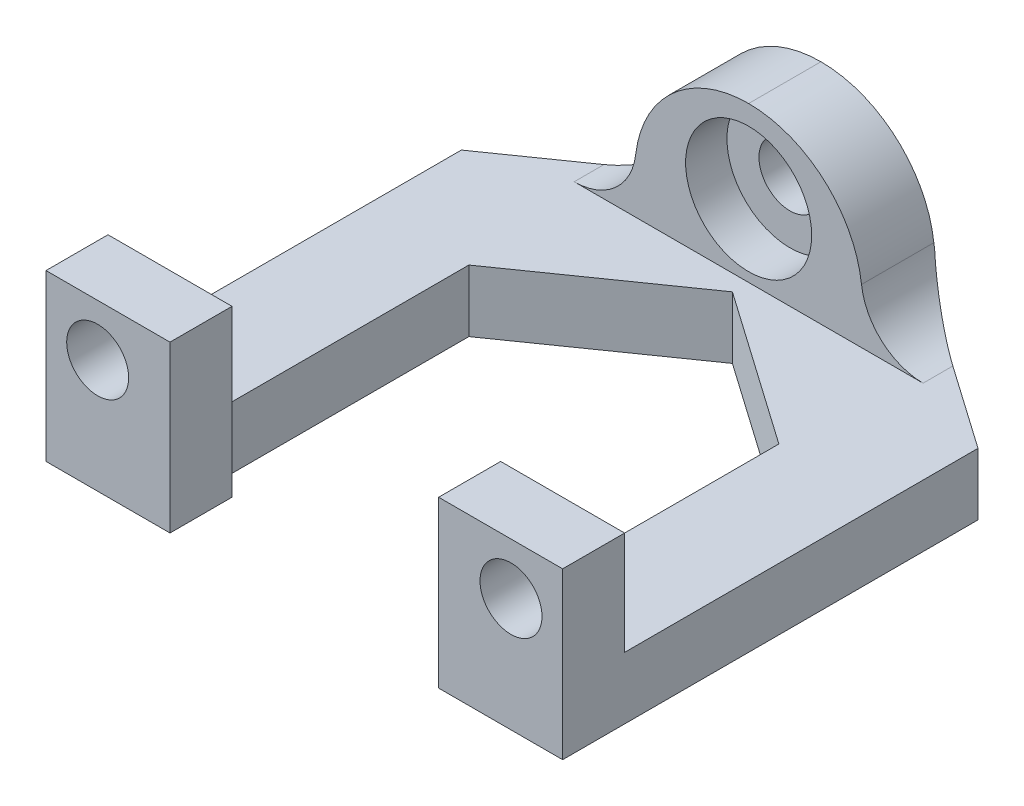
ISO-10303-21;
HEADER;
FILE_DESCRIPTION(('STEP AP214'),'2;1');
FILE_NAME('part.step','',(''),(''),'','','');
FILE_SCHEMA(('AUTOMOTIVE_DESIGN { 1 0 10303 214 1 1 1 1 }'));
ENDSEC;
DATA;
#1=APPLICATION_CONTEXT('core data for automotive mechanical design processes');
#2=APPLICATION_PROTOCOL_DEFINITION('international standard','automotive_design',2000,#1);
#3=PRODUCT_CONTEXT('',#1,'mechanical');
#4=PRODUCT('Part','Part','',(#3));
#5=PRODUCT_RELATED_PRODUCT_CATEGORY('part','',(#4));
#6=PRODUCT_DEFINITION_FORMATION('','',#4);
#7=PRODUCT_DEFINITION_CONTEXT('part definition',#1,'design');
#8=PRODUCT_DEFINITION('design','',#6,#7);
#9=PRODUCT_DEFINITION_SHAPE('','',#8);
#10=(LENGTH_UNIT() NAMED_UNIT(*) SI_UNIT(.MILLI.,.METRE.));
#11=(NAMED_UNIT(*) PLANE_ANGLE_UNIT() SI_UNIT($,.RADIAN.));
#12=(NAMED_UNIT(*) SI_UNIT($,.STERADIAN.) SOLID_ANGLE_UNIT());
#13=UNCERTAINTY_MEASURE_WITH_UNIT(LENGTH_MEASURE(1.E-05),#10,'distance_accuracy_value','');
#14=(GEOMETRIC_REPRESENTATION_CONTEXT(3) GLOBAL_UNCERTAINTY_ASSIGNED_CONTEXT((#13)) GLOBAL_UNIT_ASSIGNED_CONTEXT((#10,
#11,#12)) REPRESENTATION_CONTEXT('',''));
#15=CARTESIAN_POINT('',(0.,0.,0.));
#16=DIRECTION('',(0.,0.,1.));
#17=DIRECTION('',(1.,0.,0.));
#18=AXIS2_PLACEMENT_3D('',#15,#16,#17);
#19=CARTESIAN_POINT('',(-7.5,3.,0.));
#20=DIRECTION('',(-1.,0.,0.));
#21=DIRECTION('',(0.,0.,1.));
#22=AXIS2_PLACEMENT_3D('',#19,#20,#21);
#23=PLANE('',#22);
#24=DIRECTION('',(0.,1.,0.));
#25=VECTOR('',#24,1.);
#26=CARTESIAN_POINT('',(-7.5,0.,9.5));
#27=LINE('',#26,#25);
#28=CARTESIAN_POINT('',(-7.5,0.,9.5));
#29=VERTEX_POINT('',#28);
#30=CARTESIAN_POINT('',(-7.5,3.,9.5));
#31=VERTEX_POINT('',#30);
#32=EDGE_CURVE('E53',#29,#31,#27,.T.);
#33=ORIENTED_EDGE('',*,*,#32,.F.);
#34=DIRECTION('',(0.,0.,-1.));
#35=VECTOR('',#34,1.);
#36=CARTESIAN_POINT('',(-7.5,0.,0.));
#37=LINE('',#36,#35);
#38=CARTESIAN_POINT('',(-7.5,0.,-2.96272917771288));
#39=VERTEX_POINT('',#38);
#40=EDGE_CURVE('E198',#29,#39,#37,.T.);
#41=ORIENTED_EDGE('',*,*,#40,.T.);
#42=DIRECTION('',(0.,-1.,0.));
#43=VECTOR('',#42,1.);
#44=CARTESIAN_POINT('',(-7.5,3.,-2.96272917771288));
#45=LINE('',#44,#43);
#46=CARTESIAN_POINT('',(-7.5,3.,-2.96272917771288));
#47=VERTEX_POINT('',#46);
#48=EDGE_CURVE('E398',#47,#39,#45,.T.);
#49=ORIENTED_EDGE('',*,*,#48,.F.);
#50=DIRECTION('',(0.,0.,-1.));
#51=VECTOR('',#50,1.);
#52=CARTESIAN_POINT('',(-7.5,3.,0.));
#53=LINE('',#52,#51);
#54=EDGE_CURVE('E288',#31,#47,#53,.T.);
#55=ORIENTED_EDGE('',*,*,#54,.F.);
#56=EDGE_LOOP('',(#33,#41,#49,#55));
#57=FACE_BOUND('',#56,.T.);
#58=ADVANCED_FACE('F37',(#57),#23,.F.);
#59=CARTESIAN_POINT('',(7.5,3.,0.));
#60=DIRECTION('',(-1.,0.,0.));
#61=DIRECTION('',(0.,0.,1.));
#62=AXIS2_PLACEMENT_3D('',#59,#60,#61);
#63=PLANE('',#62);
#64=DIRECTION('',(0.,0.,-1.));
#65=VECTOR('',#64,1.);
#66=CARTESIAN_POINT('',(7.5,0.,0.));
#67=LINE('',#66,#65);
#68=CARTESIAN_POINT('',(7.5,0.,9.5));
#69=VERTEX_POINT('',#68);
#70=CARTESIAN_POINT('',(7.5,0.,-2.96272917771288));
#71=VERTEX_POINT('',#70);
#72=EDGE_CURVE('E61',#69,#71,#67,.T.);
#73=ORIENTED_EDGE('',*,*,#72,.F.);
#74=DIRECTION('',(0.,-1.,0.));
#75=VECTOR('',#74,1.);
#76=CARTESIAN_POINT('',(7.5,0.,9.5));
#77=LINE('',#76,#75);
#78=CARTESIAN_POINT('',(7.5,3.,9.5));
#79=VERTEX_POINT('',#78);
#80=EDGE_CURVE('E229',#79,#69,#77,.T.);
#81=ORIENTED_EDGE('',*,*,#80,.F.);
#82=DIRECTION('',(0.,0.,-1.));
#83=VECTOR('',#82,1.);
#84=CARTESIAN_POINT('',(7.5,3.,0.));
#85=LINE('',#84,#83);
#86=CARTESIAN_POINT('',(7.5,3.,-2.96272917771288));
#87=VERTEX_POINT('',#86);
#88=EDGE_CURVE('E479',#79,#87,#85,.T.);
#89=ORIENTED_EDGE('',*,*,#88,.T.);
#90=DIRECTION('',(0.,-1.,0.));
#91=VECTOR('',#90,1.);
#92=CARTESIAN_POINT('',(7.5,3.,-2.96272917771288));
#93=LINE('',#92,#91);
#94=EDGE_CURVE('E405',#87,#71,#93,.T.);
#95=ORIENTED_EDGE('',*,*,#94,.T.);
#96=EDGE_LOOP('',(#73,#81,#89,#95));
#97=FACE_BOUND('',#96,.T.);
#98=ADVANCED_FACE('F439',(#97),#63,.T.);
#99=CARTESIAN_POINT('',(0.,6.5,12.5));
#100=DIRECTION('',(0.,0.,-1.));
#101=DIRECTION('',(-1.,0.,0.));
#102=AXIS2_PLACEMENT_3D('',#99,#100,#101);
#103=CYLINDRICAL_SURFACE('',#102,1.5);
#104=CARTESIAN_POINT('',(0.,6.5,-12.5));
#105=DIRECTION('',(0.,0.,-1.));
#106=DIRECTION('',(-1.,0.,0.));
#107=AXIS2_PLACEMENT_3D('',#104,#105,#106);
#108=CIRCLE('',#107,1.5);
#109=CARTESIAN_POINT('',(-1.5,6.5,-12.5));
#110=VERTEX_POINT('',#109);
#111=EDGE_CURVE('E247',#110,#110,#108,.T.);
#112=ORIENTED_EDGE('',*,*,#111,.T.);
#113=EDGE_LOOP('',(#112));
#114=FACE_BOUND('',#113,.T.);
#115=CARTESIAN_POINT('',(0.,6.5,-11.));
#116=DIRECTION('',(0.,0.,1.));
#117=DIRECTION('',(1.,0.,0.));
#118=AXIS2_PLACEMENT_3D('',#115,#116,#117);
#119=CIRCLE('',#118,1.5);
#120=CARTESIAN_POINT('',(1.5,6.5,-11.));
#121=VERTEX_POINT('',#120);
#122=EDGE_CURVE('E41',#121,#121,#119,.F.);
#123=ORIENTED_EDGE('',*,*,#122,.F.);
#124=EDGE_LOOP('',(#123));
#125=FACE_BOUND('',#124,.T.);
#126=ADVANCED_FACE('F444',(#114,#125),#103,.F.);
#127=CARTESIAN_POINT('',(0.,3.,0.));
#128=DIRECTION('',(0.,1.,0.));
#129=DIRECTION('',(0.,0.,1.));
#130=AXIS2_PLACEMENT_3D('',#127,#128,#129);
#131=PLANE('',#130);
#132=DIRECTION('',(1.,0.,0.));
#133=VECTOR('',#132,1.);
#134=CARTESIAN_POINT('',(-5.5,3.,-9.));
#135=LINE('',#134,#133);
#136=CARTESIAN_POINT('',(-8.44097150806707,3.,-9.));
#137=VERTEX_POINT('',#136);
#138=CARTESIAN_POINT('',(8.44097150806707,3.,-9.));
#139=VERTEX_POINT('',#138);
#140=EDGE_CURVE('E251',#137,#139,#135,.T.);
#141=ORIENTED_EDGE('',*,*,#140,.F.);
#142=DIRECTION('',(0.,0.,1.));
#143=VECTOR('',#142,1.);
#144=CARTESIAN_POINT('',(-8.44097150806707,3.,-12.5));
#145=LINE('',#144,#143);
#146=CARTESIAN_POINT('',(-8.44097150806707,3.,-10.4407095803915));
#147=VERTEX_POINT('',#146);
#148=EDGE_CURVE('E333',#137,#147,#145,.F.);
#149=ORIENTED_EDGE('',*,*,#148,.T.);
#150=DIRECTION('',(0.819152044288993,0.,-0.573576436351044));
#151=VECTOR('',#150,1.);
#152=CARTESIAN_POINT('',(-7.68252348576631,3.,-10.9717806029467));
#153=LINE('',#152,#151);
#154=CARTESIAN_POINT('',(-12.5,3.,-7.59854723253204));
#155=VERTEX_POINT('',#154);
#156=EDGE_CURVE('E303',#147,#155,#153,.F.);
#157=ORIENTED_EDGE('',*,*,#156,.T.);
#158=DIRECTION('',(0.,0.,-1.));
#159=VECTOR('',#158,1.);
#160=CARTESIAN_POINT('',(-12.5,3.,0.));
#161=LINE('',#160,#159);
#162=CARTESIAN_POINT('',(-12.5,3.,9.5));
#163=VERTEX_POINT('',#162);
#164=EDGE_CURVE('E388',#163,#155,#161,.T.);
#165=ORIENTED_EDGE('',*,*,#164,.F.);
#166=DIRECTION('',(1.,0.,0.));
#167=VECTOR('',#166,1.);
#168=CARTESIAN_POINT('',(-12.5,3.,9.5));
#169=LINE('',#168,#167);
#170=EDGE_CURVE('E284',#163,#31,#169,.T.);
#171=ORIENTED_EDGE('',*,*,#170,.T.);
#172=ORIENTED_EDGE('',*,*,#54,.T.);
#173=DIRECTION('',(0.819152044288991,0.,-0.573576436351047));
#174=VECTOR('',#173,1.);
#175=CARTESIAN_POINT('',(-3.8594518353707,3.,-5.51186844580185));
#176=LINE('',#175,#174);
#177=CARTESIAN_POINT('',(0.,3.,-8.21428571428572));
#178=VERTEX_POINT('',#177);
#179=EDGE_CURVE('E397',#47,#178,#176,.T.);
#180=ORIENTED_EDGE('',*,*,#179,.T.);
#181=DIRECTION('',(0.819152044288991,0.,0.573576436351047));
#182=VECTOR('',#181,1.);
#183=CARTESIAN_POINT('',(3.8594518353707,3.,-5.51186844580185));
#184=LINE('',#183,#182);
#185=EDGE_CURVE('E482',#178,#87,#184,.T.);
#186=ORIENTED_EDGE('',*,*,#185,.T.);
#187=ORIENTED_EDGE('',*,*,#88,.F.);
#188=DIRECTION('',(1.,0.,0.));
#189=VECTOR('',#188,1.);
#190=CARTESIAN_POINT('',(7.5,3.,9.5));
#191=LINE('',#190,#189);
#192=CARTESIAN_POINT('',(12.5,3.,9.5));
#193=VERTEX_POINT('',#192);
#194=EDGE_CURVE('E266',#79,#193,#191,.T.);
#195=ORIENTED_EDGE('',*,*,#194,.T.);
#196=DIRECTION('',(0.,0.,-1.));
#197=VECTOR('',#196,1.);
#198=CARTESIAN_POINT('',(12.5,3.,0.));
#199=LINE('',#198,#197);
#200=CARTESIAN_POINT('',(12.5,3.,-7.59854723253203));
#201=VERTEX_POINT('',#200);
#202=EDGE_CURVE('E360',#193,#201,#199,.T.);
#203=ORIENTED_EDGE('',*,*,#202,.T.);
#204=DIRECTION('',(-0.819152044288993,0.,-0.573576436351044));
#205=VECTOR('',#204,1.);
#206=CARTESIAN_POINT('',(7.68252348576631,3.,-10.9717806029467));
#207=LINE('',#206,#205);
#208=CARTESIAN_POINT('',(8.44097150806707,3.,-10.4407095803914));
#209=VERTEX_POINT('',#208);
#210=EDGE_CURVE('E312',#201,#209,#207,.T.);
#211=ORIENTED_EDGE('',*,*,#210,.T.);
#212=DIRECTION('',(0.,0.,-1.));
#213=VECTOR('',#212,1.);
#214=CARTESIAN_POINT('',(8.44097150806707,3.,-9.));
#215=LINE('',#214,#213);
#216=EDGE_CURVE('E330',#209,#139,#215,.F.);
#217=ORIENTED_EDGE('',*,*,#216,.T.);
#218=EDGE_LOOP('',(#141,#149,#157,#165,#171,#172,#180,#186,#187,#195,#203,#211,#217));
#219=FACE_BOUND('',#218,.T.);
#220=ADVANCED_FACE('F358',(#219),#131,.T.);
#221=CARTESIAN_POINT('',(-3.8594518353707,3.,-5.51186844580185));
#222=DIRECTION('',(-0.573576436351047,0.,-0.819152044288991));
#223=DIRECTION('',(-0.819152044288991,0.,0.573576436351047));
#224=AXIS2_PLACEMENT_3D('',#221,#222,#223);
#225=PLANE('',#224);
#226=DIRECTION('',(0.819152044288991,0.,-0.573576436351047));
#227=VECTOR('',#226,1.);
#228=CARTESIAN_POINT('',(-3.8594518353707,0.,-5.51186844580185));
#229=LINE('',#228,#227);
#230=CARTESIAN_POINT('',(0.,0.,-8.21428571428572));
#231=VERTEX_POINT('',#230);
#232=EDGE_CURVE('E414',#39,#231,#229,.T.);
#233=ORIENTED_EDGE('',*,*,#232,.T.);
#234=DIRECTION('',(0.,-1.,0.));
#235=VECTOR('',#234,1.);
#236=CARTESIAN_POINT('',(0.,3.,-8.21428571428572));
#237=LINE('',#236,#235);
#238=EDGE_CURVE('E299',#178,#231,#237,.T.);
#239=ORIENTED_EDGE('',*,*,#238,.F.);
#240=ORIENTED_EDGE('',*,*,#179,.F.);
#241=ORIENTED_EDGE('',*,*,#48,.T.);
#242=EDGE_LOOP('',(#233,#239,#240,#241));
#243=FACE_BOUND('',#242,.T.);
#244=ADVANCED_FACE('F461',(#243),#225,.F.);
#245=CARTESIAN_POINT('',(3.8594518353707,3.,-5.51186844580185));
#246=DIRECTION('',(0.573576436351047,0.,-0.819152044288991));
#247=DIRECTION('',(-0.819152044288991,0.,-0.573576436351047));
#248=AXIS2_PLACEMENT_3D('',#245,#246,#247);
#249=PLANE('',#248);
#250=DIRECTION('',(0.819152044288991,0.,0.573576436351047));
#251=VECTOR('',#250,1.);
#252=CARTESIAN_POINT('',(3.8594518353707,0.,-5.51186844580185));
#253=LINE('',#252,#251);
#254=EDGE_CURVE('E417',#231,#71,#253,.T.);
#255=ORIENTED_EDGE('',*,*,#254,.T.);
#256=ORIENTED_EDGE('',*,*,#94,.F.);
#257=ORIENTED_EDGE('',*,*,#185,.F.);
#258=ORIENTED_EDGE('',*,*,#238,.T.);
#259=EDGE_LOOP('',(#255,#256,#257,#258));
#260=FACE_BOUND('',#259,.T.);
#261=ADVANCED_FACE('F456',(#260),#249,.F.);
#262=CARTESIAN_POINT('',(0.,3.,12.5));
#263=DIRECTION('',(0.,0.,-1.));
#264=DIRECTION('',(-1.,0.,0.));
#265=AXIS2_PLACEMENT_3D('',#262,#263,#264);
#266=PLANE('',#265);
#267=CARTESIAN_POINT('',(10.,5.5,12.5));
#268=DIRECTION('',(0.,0.,-1.));
#269=DIRECTION('',(1.,0.,0.));
#270=AXIS2_PLACEMENT_3D('',#267,#268,#269);
#271=CIRCLE('',#270,1.5);
#272=CARTESIAN_POINT('',(11.5,5.5,12.5));
#273=VERTEX_POINT('',#272);
#274=EDGE_CURVE('E254',#273,#273,#271,.T.);
#275=ORIENTED_EDGE('',*,*,#274,.T.);
#276=EDGE_LOOP('',(#275));
#277=FACE_BOUND('',#276,.T.);
#278=DIRECTION('',(1.,0.,0.));
#279=VECTOR('',#278,1.);
#280=CARTESIAN_POINT('',(0.,0.,12.5));
#281=LINE('',#280,#279);
#282=CARTESIAN_POINT('',(6.5,0.,12.5));
#283=VERTEX_POINT('',#282);
#284=CARTESIAN_POINT('',(12.5,0.,12.5));
#285=VERTEX_POINT('',#284);
#286=EDGE_CURVE('E201',#283,#285,#281,.T.);
#287=ORIENTED_EDGE('',*,*,#286,.T.);
#288=DIRECTION('',(0.,-1.,0.));
#289=VECTOR('',#288,1.);
#290=CARTESIAN_POINT('',(12.5,3.,12.5));
#291=LINE('',#290,#289);
#292=CARTESIAN_POINT('',(12.5,8.,12.5));
#293=VERTEX_POINT('',#292);
#294=EDGE_CURVE('E402',#293,#285,#291,.T.);
#295=ORIENTED_EDGE('',*,*,#294,.F.);
#296=DIRECTION('',(-1.,0.,0.));
#297=VECTOR('',#296,1.);
#298=CARTESIAN_POINT('',(7.5,8.,12.5));
#299=LINE('',#298,#297);
#300=CARTESIAN_POINT('',(6.5,8.,12.5));
#301=VERTEX_POINT('',#300);
#302=EDGE_CURVE('E263',#293,#301,#299,.T.);
#303=ORIENTED_EDGE('',*,*,#302,.T.);
#304=DIRECTION('',(0.,1.,0.));
#305=VECTOR('',#304,1.);
#306=CARTESIAN_POINT('',(6.5,0.,12.5));
#307=LINE('',#306,#305);
#308=EDGE_CURVE('E225',#283,#301,#307,.T.);
#309=ORIENTED_EDGE('',*,*,#308,.F.);
#310=EDGE_LOOP('',(#287,#295,#303,#309));
#311=FACE_BOUND('',#310,.T.);
#312=ADVANCED_FACE('F435',(#277,#311),#266,.F.);
#313=CARTESIAN_POINT('',(12.5,3.,0.));
#314=DIRECTION('',(-1.,0.,0.));
#315=DIRECTION('',(0.,0.,1.));
#316=AXIS2_PLACEMENT_3D('',#313,#314,#315);
#317=PLANE('',#316);
#318=DIRECTION('',(0.,0.,-1.));
#319=VECTOR('',#318,1.);
#320=CARTESIAN_POINT('',(12.5,0.,0.));
#321=LINE('',#320,#319);
#322=CARTESIAN_POINT('',(12.5,0.,-7.59854723253203));
#323=VERTEX_POINT('',#322);
#324=EDGE_CURVE('E392',#285,#323,#321,.T.);
#325=ORIENTED_EDGE('',*,*,#324,.T.);
#326=DIRECTION('',(0.,1.,0.));
#327=VECTOR('',#326,1.);
#328=CARTESIAN_POINT('',(12.5,3.,-7.59854723253203));
#329=LINE('',#328,#327);
#330=EDGE_CURVE('E310',#323,#201,#329,.T.);
#331=ORIENTED_EDGE('',*,*,#330,.T.);
#332=ORIENTED_EDGE('',*,*,#202,.F.);
#333=DIRECTION('',(0.,1.,0.));
#334=VECTOR('',#333,1.);
#335=CARTESIAN_POINT('',(12.5,3.,9.5));
#336=LINE('',#335,#334);
#337=CARTESIAN_POINT('',(12.5,8.,9.5));
#338=VERTEX_POINT('',#337);
#339=EDGE_CURVE('E269',#193,#338,#336,.T.);
#340=ORIENTED_EDGE('',*,*,#339,.T.);
#341=DIRECTION('',(0.,0.,1.));
#342=VECTOR('',#341,1.);
#343=CARTESIAN_POINT('',(12.5,8.,9.5));
#344=LINE('',#343,#342);
#345=EDGE_CURVE('E274',#338,#293,#344,.T.);
#346=ORIENTED_EDGE('',*,*,#345,.T.);
#347=ORIENTED_EDGE('',*,*,#294,.T.);
#348=EDGE_LOOP('',(#325,#331,#332,#340,#346,#347));
#349=FACE_BOUND('',#348,.T.);
#350=ADVANCED_FACE('F424',(#349),#317,.F.);
#351=CARTESIAN_POINT('',(0.,3.,-12.5));
#352=DIRECTION('',(0.,0.,-1.));
#353=DIRECTION('',(-1.,0.,0.));
#354=AXIS2_PLACEMENT_3D('',#351,#352,#353);
#355=PLANE('',#354);
#356=ORIENTED_EDGE('',*,*,#111,.F.);
#357=EDGE_LOOP('',(#356));
#358=FACE_BOUND('',#357,.T.);
#359=DIRECTION('',(0.,1.,0.));
#360=VECTOR('',#359,1.);
#361=CARTESIAN_POINT('',(-5.49999999999997,3.,-12.5));
#362=LINE('',#361,#360);
#363=CARTESIAN_POINT('',(-5.49999999999997,0.,-12.5));
#364=VERTEX_POINT('',#363);
#365=CARTESIAN_POINT('',(-5.49999999999997,5.40781203259641,-12.5));
#366=VERTEX_POINT('',#365);
#367=EDGE_CURVE('E301',#364,#366,#362,.T.);
#368=ORIENTED_EDGE('',*,*,#367,.T.);
#369=CARTESIAN_POINT('',(-8.44097150806707,6.,-12.5));
#370=DIRECTION('',(0.,0.,-1.));
#371=DIRECTION('',(-1.,0.,0.));
#372=AXIS2_PLACEMENT_3D('',#369,#370,#371);
#373=CIRCLE('',#372,3.);
#374=CARTESIAN_POINT('',(-5.46180509345516,5.64705882352941,-12.5));
#375=VERTEX_POINT('',#374);
#376=EDGE_CURVE('E344',#366,#375,#373,.F.);
#377=ORIENTED_EDGE('',*,*,#376,.T.);
#378=CARTESIAN_POINT('',(0.,5.,-12.5));
#379=DIRECTION('',(0.,0.,-1.));
#380=DIRECTION('',(-1.,0.,0.));
#381=AXIS2_PLACEMENT_3D('',#378,#379,#380);
#382=CIRCLE('',#381,5.5);
#383=CARTESIAN_POINT('',(0.,10.5,-12.5));
#384=VERTEX_POINT('',#383);
#385=EDGE_CURVE('E315',#375,#384,#382,.T.);
#386=ORIENTED_EDGE('',*,*,#385,.T.);
#387=CARTESIAN_POINT('',(0.,5.,-12.5));
#388=DIRECTION('',(0.,0.,-1.));
#389=DIRECTION('',(-1.,0.,0.));
#390=AXIS2_PLACEMENT_3D('',#387,#388,#389);
#391=CIRCLE('',#390,5.5);
#392=CARTESIAN_POINT('',(5.46180509345516,5.64705882352941,-12.5));
#393=VERTEX_POINT('',#392);
#394=EDGE_CURVE('E317',#384,#393,#391,.T.);
#395=ORIENTED_EDGE('',*,*,#394,.T.);
#396=CARTESIAN_POINT('',(8.44097150806707,6.,-12.5));
#397=DIRECTION('',(0.,0.,-1.));
#398=DIRECTION('',(-1.,0.,0.));
#399=AXIS2_PLACEMENT_3D('',#396,#397,#398);
#400=CIRCLE('',#399,3.);
#401=CARTESIAN_POINT('',(5.49999999999997,5.40781203259645,-12.5));
#402=VERTEX_POINT('',#401);
#403=EDGE_CURVE('E346',#393,#402,#400,.F.);
#404=ORIENTED_EDGE('',*,*,#403,.T.);
#405=DIRECTION('',(0.,-1.,0.));
#406=VECTOR('',#405,1.);
#407=CARTESIAN_POINT('',(5.49999999999997,0.,-12.5));
#408=LINE('',#407,#406);
#409=CARTESIAN_POINT('',(5.49999999999997,0.,-12.5));
#410=VERTEX_POINT('',#409);
#411=EDGE_CURVE('E305',#402,#410,#408,.T.);
#412=ORIENTED_EDGE('',*,*,#411,.T.);
#413=DIRECTION('',(1.,0.,0.));
#414=VECTOR('',#413,1.);
#415=CARTESIAN_POINT('',(0.,0.,-12.5));
#416=LINE('',#415,#414);
#417=EDGE_CURVE('E390',#364,#410,#416,.T.);
#418=ORIENTED_EDGE('',*,*,#417,.F.);
#419=EDGE_LOOP('',(#368,#377,#386,#395,#404,#412,#418));
#420=FACE_BOUND('',#419,.T.);
#421=ADVANCED_FACE('F426',(#358,#420),#355,.T.);
#422=CARTESIAN_POINT('',(-12.5,3.,0.));
#423=DIRECTION('',(-1.,0.,0.));
#424=DIRECTION('',(0.,0.,1.));
#425=AXIS2_PLACEMENT_3D('',#422,#423,#424);
#426=PLANE('',#425);
#427=ORIENTED_EDGE('',*,*,#164,.T.);
#428=DIRECTION('',(0.,-1.,0.));
#429=VECTOR('',#428,1.);
#430=CARTESIAN_POINT('',(-12.5,3.,-7.59854723253204));
#431=LINE('',#430,#429);
#432=CARTESIAN_POINT('',(-12.5,0.,-7.59854723253204));
#433=VERTEX_POINT('',#432);
#434=EDGE_CURVE('E295',#155,#433,#431,.T.);
#435=ORIENTED_EDGE('',*,*,#434,.T.);
#436=DIRECTION('',(0.,0.,-1.));
#437=VECTOR('',#436,1.);
#438=CARTESIAN_POINT('',(-12.5,0.,0.));
#439=LINE('',#438,#437);
#440=CARTESIAN_POINT('',(-12.5,0.,12.5));
#441=VERTEX_POINT('',#440);
#442=EDGE_CURVE('E199',#441,#433,#439,.T.);
#443=ORIENTED_EDGE('',*,*,#442,.F.);
#444=DIRECTION('',(0.,-1.,0.));
#445=VECTOR('',#444,1.);
#446=CARTESIAN_POINT('',(-12.5,3.,12.5));
#447=LINE('',#446,#445);
#448=CARTESIAN_POINT('',(-12.5,8.,12.5));
#449=VERTEX_POINT('',#448);
#450=EDGE_CURVE('E194',#449,#441,#447,.T.);
#451=ORIENTED_EDGE('',*,*,#450,.F.);
#452=DIRECTION('',(0.,0.,1.));
#453=VECTOR('',#452,1.);
#454=CARTESIAN_POINT('',(-12.5,8.,9.5));
#455=LINE('',#454,#453);
#456=CARTESIAN_POINT('',(-12.5,8.,9.5));
#457=VERTEX_POINT('',#456);
#458=EDGE_CURVE('E418',#457,#449,#455,.T.);
#459=ORIENTED_EDGE('',*,*,#458,.F.);
#460=DIRECTION('',(0.,-1.,0.));
#461=VECTOR('',#460,1.);
#462=CARTESIAN_POINT('',(-12.5,3.,9.5));
#463=LINE('',#462,#461);
#464=EDGE_CURVE('E287',#457,#163,#463,.T.);
#465=ORIENTED_EDGE('',*,*,#464,.T.);
#466=EDGE_LOOP('',(#427,#435,#443,#451,#459,#465));
#467=FACE_BOUND('',#466,.T.);
#468=ADVANCED_FACE('F387',(#467),#426,.T.);
#469=CARTESIAN_POINT('',(-10.,5.5,12.5));
#470=DIRECTION('',(0.,0.,-1.));
#471=DIRECTION('',(-1.,0.,0.));
#472=AXIS2_PLACEMENT_3D('',#469,#470,#471);
#473=CIRCLE('',#472,1.5);
#474=CARTESIAN_POINT('',(-11.5,5.5,12.5));
#475=VERTEX_POINT('',#474);
#476=EDGE_CURVE('E260',#475,#475,#473,.T.);
#477=ORIENTED_EDGE('',*,*,#476,.T.);
#478=EDGE_LOOP('',(#477));
#479=FACE_BOUND('',#478,.T.);
#480=CARTESIAN_POINT('',(-6.5,0.,12.5));
#481=VERTEX_POINT('',#480);
#482=EDGE_CURVE('E188',#441,#481,#281,.T.);
#483=ORIENTED_EDGE('',*,*,#482,.T.);
#484=DIRECTION('',(0.,-1.,0.));
#485=VECTOR('',#484,1.);
#486=CARTESIAN_POINT('',(-6.5,0.,12.5));
#487=LINE('',#486,#485);
#488=CARTESIAN_POINT('',(-6.5,8.,12.5));
#489=VERTEX_POINT('',#488);
#490=EDGE_CURVE('E193',#489,#481,#487,.T.);
#491=ORIENTED_EDGE('',*,*,#490,.F.);
#492=DIRECTION('',(-1.,0.,0.));
#493=VECTOR('',#492,1.);
#494=CARTESIAN_POINT('',(-12.5,8.,12.5));
#495=LINE('',#494,#493);
#496=EDGE_CURVE('E278',#489,#449,#495,.T.);
#497=ORIENTED_EDGE('',*,*,#496,.T.);
#498=ORIENTED_EDGE('',*,*,#450,.T.);
#499=EDGE_LOOP('',(#483,#491,#497,#498));
#500=FACE_BOUND('',#499,.T.);
#501=ADVANCED_FACE('F190',(#479,#500),#266,.F.);
#502=CARTESIAN_POINT('',(0.,0.,0.));
#503=DIRECTION('',(0.,1.,0.));
#504=DIRECTION('',(0.,0.,1.));
#505=AXIS2_PLACEMENT_3D('',#502,#503,#504);
#506=PLANE('',#505);
#507=ORIENTED_EDGE('',*,*,#417,.T.);
#508=DIRECTION('',(0.819152044288993,0.,0.573576436351044));
#509=VECTOR('',#508,1.);
#510=CARTESIAN_POINT('',(5.49999999999997,0.,-12.5));
#511=LINE('',#510,#509);
#512=EDGE_CURVE('E308',#410,#323,#511,.T.);
#513=ORIENTED_EDGE('',*,*,#512,.T.);
#514=ORIENTED_EDGE('',*,*,#324,.F.);
#515=ORIENTED_EDGE('',*,*,#286,.F.);
#516=DIRECTION('',(0.,0.,1.));
#517=VECTOR('',#516,1.);
#518=CARTESIAN_POINT('',(6.5,0.,12.5));
#519=LINE('',#518,#517);
#520=CARTESIAN_POINT('',(6.5,0.,9.5));
#521=VERTEX_POINT('',#520);
#522=EDGE_CURVE('E234',#521,#283,#519,.T.);
#523=ORIENTED_EDGE('',*,*,#522,.F.);
#524=DIRECTION('',(1.,0.,0.));
#525=VECTOR('',#524,1.);
#526=CARTESIAN_POINT('',(6.5,0.,9.5));
#527=LINE('',#526,#525);
#528=EDGE_CURVE('E237',#521,#69,#527,.T.);
#529=ORIENTED_EDGE('',*,*,#528,.T.);
#530=ORIENTED_EDGE('',*,*,#72,.T.);
#531=ORIENTED_EDGE('',*,*,#254,.F.);
#532=ORIENTED_EDGE('',*,*,#232,.F.);
#533=ORIENTED_EDGE('',*,*,#40,.F.);
#534=DIRECTION('',(-1.,0.,0.));
#535=VECTOR('',#534,1.);
#536=CARTESIAN_POINT('',(-6.5,0.,9.5));
#537=LINE('',#536,#535);
#538=CARTESIAN_POINT('',(-6.5,0.,9.5));
#539=VERTEX_POINT('',#538);
#540=EDGE_CURVE('E207',#539,#29,#537,.T.);
#541=ORIENTED_EDGE('',*,*,#540,.F.);
#542=DIRECTION('',(0.,0.,-1.));
#543=VECTOR('',#542,1.);
#544=CARTESIAN_POINT('',(-6.5,0.,12.5));
#545=LINE('',#544,#543);
#546=EDGE_CURVE('E203',#481,#539,#545,.T.);
#547=ORIENTED_EDGE('',*,*,#546,.F.);
#548=ORIENTED_EDGE('',*,*,#482,.F.);
#549=ORIENTED_EDGE('',*,*,#442,.T.);
#550=DIRECTION('',(-0.819152044288993,0.,0.573576436351044));
#551=VECTOR('',#550,1.);
#552=CARTESIAN_POINT('',(-12.5,0.,-7.59854723253204));
#553=LINE('',#552,#551);
#554=EDGE_CURVE('E298',#433,#364,#553,.F.);
#555=ORIENTED_EDGE('',*,*,#554,.T.);
#556=EDGE_LOOP('',(#507,#513,#514,#515,#523,#529,#530,#531,#532,#533,#541,#547,#548,#549,#555));
#557=FACE_BOUND('',#556,.T.);
#558=ADVANCED_FACE('F205',(#557),#506,.F.);
#559=CARTESIAN_POINT('',(-12.5,8.,9.5));
#560=DIRECTION('',(0.,1.,0.));
#561=DIRECTION('',(0.,0.,1.));
#562=AXIS2_PLACEMENT_3D('',#559,#560,#561);
#563=PLANE('',#562);
#564=ORIENTED_EDGE('',*,*,#496,.F.);
#565=DIRECTION('',(0.,0.,1.));
#566=VECTOR('',#565,1.);
#567=CARTESIAN_POINT('',(-6.5,8.,12.5));
#568=LINE('',#567,#566);
#569=CARTESIAN_POINT('',(-6.5,8.,9.5));
#570=VERTEX_POINT('',#569);
#571=EDGE_CURVE('E216',#570,#489,#568,.T.);
#572=ORIENTED_EDGE('',*,*,#571,.F.);
#573=DIRECTION('',(-1.,0.,0.));
#574=VECTOR('',#573,1.);
#575=CARTESIAN_POINT('',(-12.5,8.,9.5));
#576=LINE('',#575,#574);
#577=EDGE_CURVE('E281',#570,#457,#576,.T.);
#578=ORIENTED_EDGE('',*,*,#577,.T.);
#579=ORIENTED_EDGE('',*,*,#458,.T.);
#580=EDGE_LOOP('',(#564,#572,#578,#579));
#581=FACE_BOUND('',#580,.T.);
#582=ADVANCED_FACE('F454',(#581),#563,.T.);
#583=CARTESIAN_POINT('',(0.,0.,9.5));
#584=DIRECTION('',(0.,0.,-1.));
#585=DIRECTION('',(-1.,0.,0.));
#586=AXIS2_PLACEMENT_3D('',#583,#584,#585);
#587=PLANE('',#586);
#588=CARTESIAN_POINT('',(-10.,5.5,9.5));
#589=DIRECTION('',(0.,0.,-1.));
#590=DIRECTION('',(-1.,0.,0.));
#591=AXIS2_PLACEMENT_3D('',#588,#589,#590);
#592=CIRCLE('',#591,1.5);
#593=CARTESIAN_POINT('',(-11.5,5.5,9.5));
#594=VERTEX_POINT('',#593);
#595=EDGE_CURVE('E257',#594,#594,#592,.T.);
#596=ORIENTED_EDGE('',*,*,#595,.F.);
#597=EDGE_LOOP('',(#596));
#598=FACE_BOUND('',#597,.T.);
#599=ORIENTED_EDGE('',*,*,#464,.F.);
#600=ORIENTED_EDGE('',*,*,#577,.F.);
#601=DIRECTION('',(0.,1.,0.));
#602=VECTOR('',#601,1.);
#603=CARTESIAN_POINT('',(-6.5,0.,9.5));
#604=LINE('',#603,#602);
#605=EDGE_CURVE('E211',#539,#570,#604,.T.);
#606=ORIENTED_EDGE('',*,*,#605,.F.);
#607=ORIENTED_EDGE('',*,*,#540,.T.);
#608=ORIENTED_EDGE('',*,*,#32,.T.);
#609=ORIENTED_EDGE('',*,*,#170,.F.);
#610=EDGE_LOOP('',(#599,#600,#606,#607,#608,#609));
#611=FACE_BOUND('',#610,.T.);
#612=ADVANCED_FACE('F489',(#598,#611),#587,.T.);
#613=CARTESIAN_POINT('',(7.5,8.,9.5));
#614=DIRECTION('',(0.,1.,0.));
#615=DIRECTION('',(0.,0.,1.));
#616=AXIS2_PLACEMENT_3D('',#613,#614,#615);
#617=PLANE('',#616);
#618=ORIENTED_EDGE('',*,*,#302,.F.);
#619=ORIENTED_EDGE('',*,*,#345,.F.);
#620=DIRECTION('',(-1.,0.,0.));
#621=VECTOR('',#620,1.);
#622=CARTESIAN_POINT('',(7.5,8.,9.5));
#623=LINE('',#622,#621);
#624=CARTESIAN_POINT('',(6.5,8.,9.5));
#625=VERTEX_POINT('',#624);
#626=EDGE_CURVE('E272',#338,#625,#623,.T.);
#627=ORIENTED_EDGE('',*,*,#626,.T.);
#628=DIRECTION('',(0.,0.,-1.));
#629=VECTOR('',#628,1.);
#630=CARTESIAN_POINT('',(6.5,8.,12.5));
#631=LINE('',#630,#629);
#632=EDGE_CURVE('E228',#301,#625,#631,.T.);
#633=ORIENTED_EDGE('',*,*,#632,.F.);
#634=EDGE_LOOP('',(#618,#619,#627,#633));
#635=FACE_BOUND('',#634,.T.);
#636=ADVANCED_FACE('F499',(#635),#617,.T.);
#637=CARTESIAN_POINT('',(0.,0.,9.5));
#638=DIRECTION('',(0.,0.,-1.));
#639=DIRECTION('',(-1.,0.,0.));
#640=AXIS2_PLACEMENT_3D('',#637,#638,#639);
#641=PLANE('',#640);
#642=CARTESIAN_POINT('',(10.,5.5,9.5));
#643=DIRECTION('',(0.,0.,-1.));
#644=DIRECTION('',(1.,0.,0.));
#645=AXIS2_PLACEMENT_3D('',#642,#643,#644);
#646=CIRCLE('',#645,1.5);
#647=CARTESIAN_POINT('',(11.5,5.5,9.5));
#648=VERTEX_POINT('',#647);
#649=EDGE_CURVE('E253',#648,#648,#646,.T.);
#650=ORIENTED_EDGE('',*,*,#649,.F.);
#651=EDGE_LOOP('',(#650));
#652=FACE_BOUND('',#651,.T.);
#653=ORIENTED_EDGE('',*,*,#194,.F.);
#654=ORIENTED_EDGE('',*,*,#80,.T.);
#655=ORIENTED_EDGE('',*,*,#528,.F.);
#656=DIRECTION('',(0.,-1.,0.));
#657=VECTOR('',#656,1.);
#658=CARTESIAN_POINT('',(6.5,0.,9.5));
#659=LINE('',#658,#657);
#660=EDGE_CURVE('E232',#625,#521,#659,.T.);
#661=ORIENTED_EDGE('',*,*,#660,.F.);
#662=ORIENTED_EDGE('',*,*,#626,.F.);
#663=ORIENTED_EDGE('',*,*,#339,.F.);
#664=EDGE_LOOP('',(#653,#654,#655,#661,#662,#663));
#665=FACE_BOUND('',#664,.T.);
#666=ADVANCED_FACE('F475',(#652,#665),#641,.T.);
#667=CARTESIAN_POINT('',(-10.,5.5,12.5));
#668=DIRECTION('',(0.,0.,-1.));
#669=DIRECTION('',(-1.,0.,0.));
#670=AXIS2_PLACEMENT_3D('',#667,#668,#669);
#671=CYLINDRICAL_SURFACE('',#670,1.5);
#672=ORIENTED_EDGE('',*,*,#476,.F.);
#673=EDGE_LOOP('',(#672));
#674=FACE_BOUND('',#673,.T.);
#675=ORIENTED_EDGE('',*,*,#595,.T.);
#676=EDGE_LOOP('',(#675));
#677=FACE_BOUND('',#676,.T.);
#678=ADVANCED_FACE('F506',(#674,#677),#671,.F.);
#679=CARTESIAN_POINT('',(10.,5.5,12.5));
#680=DIRECTION('',(0.,0.,-1.));
#681=DIRECTION('',(-1.,0.,0.));
#682=AXIS2_PLACEMENT_3D('',#679,#680,#681);
#683=CYLINDRICAL_SURFACE('',#682,1.5);
#684=ORIENTED_EDGE('',*,*,#274,.F.);
#685=EDGE_LOOP('',(#684));
#686=FACE_BOUND('',#685,.T.);
#687=ORIENTED_EDGE('',*,*,#649,.T.);
#688=EDGE_LOOP('',(#687));
#689=FACE_BOUND('',#688,.T.);
#690=ADVANCED_FACE('F532',(#686,#689),#683,.F.);
#691=CARTESIAN_POINT('',(-12.5,3.,-7.59854723253204));
#692=DIRECTION('',(0.573576436351044,0.,0.819152044288993));
#693=DIRECTION('',(0.,-1.,0.));
#694=AXIS2_PLACEMENT_3D('',#691,#692,#693);
#695=PLANE('',#694);
#696=ORIENTED_EDGE('',*,*,#156,.F.);
#697=CARTESIAN_POINT('',(-8.44097150806707,6.,-10.4407095803915));
#698=DIRECTION('',(0.573576436351044,0.,0.819152044288993));
#699=DIRECTION('',(0.819152044288993,0.,-0.573576436351044));
#700=AXIS2_PLACEMENT_3D('',#697,#698,#699);
#701=ELLIPSE('',#700,3.66232376628436,3.);
#702=EDGE_CURVE('E341',#147,#366,#701,.T.);
#703=ORIENTED_EDGE('',*,*,#702,.T.);
#704=ORIENTED_EDGE('',*,*,#367,.F.);
#705=ORIENTED_EDGE('',*,*,#554,.F.);
#706=ORIENTED_EDGE('',*,*,#434,.F.);
#707=EDGE_LOOP('',(#696,#703,#704,#705,#706));
#708=FACE_BOUND('',#707,.T.);
#709=ADVANCED_FACE('F384',(#708),#695,.F.);
#710=CARTESIAN_POINT('',(5.49999999999997,3.,-12.5));
#711=DIRECTION('',(0.573576436351044,0.,-0.819152044288993));
#712=DIRECTION('',(0.,1.,0.));
#713=AXIS2_PLACEMENT_3D('',#710,#711,#712);
#714=PLANE('',#713);
#715=ORIENTED_EDGE('',*,*,#210,.F.);
#716=ORIENTED_EDGE('',*,*,#330,.F.);
#717=ORIENTED_EDGE('',*,*,#512,.F.);
#718=ORIENTED_EDGE('',*,*,#411,.F.);
#719=CARTESIAN_POINT('',(8.44097150806707,6.,-10.4407095803914));
#720=DIRECTION('',(0.573576436351044,0.,-0.819152044288993));
#721=DIRECTION('',(0.819152044288993,0.,0.573576436351044));
#722=AXIS2_PLACEMENT_3D('',#719,#720,#721);
#723=ELLIPSE('',#722,3.66232376628436,3.);
#724=EDGE_CURVE('E46',#402,#209,#723,.F.);
#725=ORIENTED_EDGE('',*,*,#724,.T.);
#726=EDGE_LOOP('',(#715,#716,#717,#718,#725));
#727=FACE_BOUND('',#726,.T.);
#728=ADVANCED_FACE('F352',(#727),#714,.T.);
#729=CARTESIAN_POINT('',(-5.5,7.5,-9.));
#730=DIRECTION('',(0.,0.,-1.));
#731=DIRECTION('',(-1.,0.,0.));
#732=AXIS2_PLACEMENT_3D('',#729,#730,#731);
#733=PLANE('',#732);
#734=CARTESIAN_POINT('',(0.,6.5,-9.));
#735=DIRECTION('',(0.,0.,1.));
#736=DIRECTION('',(1.,0.,0.));
#737=AXIS2_PLACEMENT_3D('',#734,#735,#736);
#738=CIRCLE('',#737,3.05);
#739=CARTESIAN_POINT('',(3.05,6.5,-9.));
#740=VERTEX_POINT('',#739);
#741=EDGE_CURVE('E241',#740,#740,#738,.T.);
#742=ORIENTED_EDGE('',*,*,#741,.F.);
#743=EDGE_LOOP('',(#742));
#744=FACE_BOUND('',#743,.T.);
#745=ORIENTED_EDGE('',*,*,#140,.T.);
#746=CARTESIAN_POINT('',(8.44097150806707,6.,-9.));
#747=DIRECTION('',(0.,0.,-1.));
#748=DIRECTION('',(-1.,0.,0.));
#749=AXIS2_PLACEMENT_3D('',#746,#747,#748);
#750=CIRCLE('',#749,3.);
#751=CARTESIAN_POINT('',(5.46180509345516,5.64705882352941,-9.));
#752=VERTEX_POINT('',#751);
#753=EDGE_CURVE('E12',#139,#752,#750,.T.);
#754=ORIENTED_EDGE('',*,*,#753,.T.);
#755=CARTESIAN_POINT('',(0.,5.,-9.));
#756=DIRECTION('',(0.,0.,-1.));
#757=DIRECTION('',(-1.,0.,0.));
#758=AXIS2_PLACEMENT_3D('',#755,#756,#757);
#759=CIRCLE('',#758,5.5);
#760=CARTESIAN_POINT('',(0.,10.5,-9.));
#761=VERTEX_POINT('',#760);
#762=EDGE_CURVE('E323',#752,#761,#759,.F.);
#763=ORIENTED_EDGE('',*,*,#762,.T.);
#764=CARTESIAN_POINT('',(0.,5.,-9.));
#765=DIRECTION('',(0.,0.,-1.));
#766=DIRECTION('',(-1.,0.,0.));
#767=AXIS2_PLACEMENT_3D('',#764,#765,#766);
#768=CIRCLE('',#767,5.5);
#769=CARTESIAN_POINT('',(-5.46180509345516,5.64705882352941,-9.));
#770=VERTEX_POINT('',#769);
#771=EDGE_CURVE('E320',#761,#770,#768,.F.);
#772=ORIENTED_EDGE('',*,*,#771,.T.);
#773=CARTESIAN_POINT('',(-8.44097150806707,6.,-9.));
#774=DIRECTION('',(0.,0.,-1.));
#775=DIRECTION('',(-1.,0.,0.));
#776=AXIS2_PLACEMENT_3D('',#773,#774,#775);
#777=CIRCLE('',#776,3.);
#778=EDGE_CURVE('E338',#770,#137,#777,.T.);
#779=ORIENTED_EDGE('',*,*,#778,.T.);
#780=EDGE_LOOP('',(#745,#754,#763,#772,#779));
#781=FACE_BOUND('',#780,.T.);
#782=ADVANCED_FACE('F364',(#744,#781),#733,.F.);
#783=CARTESIAN_POINT('',(0.,5.,0.));
#784=DIRECTION('',(0.,0.,-1.));
#785=DIRECTION('',(-1.,0.,0.));
#786=AXIS2_PLACEMENT_3D('',#783,#784,#785);
#787=CYLINDRICAL_SURFACE('',#786,5.5);
#788=ORIENTED_EDGE('',*,*,#385,.F.);
#789=DIRECTION('',(0.,0.,-1.));
#790=VECTOR('',#789,1.);
#791=CARTESIAN_POINT('',(-5.46180509345516,5.64705882352941,0.));
#792=LINE('',#791,#790);
#793=EDGE_CURVE('E325',#375,#770,#792,.F.);
#794=ORIENTED_EDGE('',*,*,#793,.T.);
#795=ORIENTED_EDGE('',*,*,#771,.F.);
#796=DIRECTION('',(0.,0.,1.));
#797=VECTOR('',#796,1.);
#798=CARTESIAN_POINT('',(0.,10.5,-9.));
#799=LINE('',#798,#797);
#800=EDGE_CURVE('E250',#384,#761,#799,.T.);
#801=ORIENTED_EDGE('',*,*,#800,.F.);
#802=EDGE_LOOP('',(#788,#794,#795,#801));
#803=FACE_BOUND('',#802,.T.);
#804=ADVANCED_FACE('F372',(#803),#787,.T.);
#805=CARTESIAN_POINT('',(0.,5.,0.));
#806=DIRECTION('',(0.,0.,1.));
#807=DIRECTION('',(1.,0.,0.));
#808=AXIS2_PLACEMENT_3D('',#805,#806,#807);
#809=CYLINDRICAL_SURFACE('',#808,5.5);
#810=ORIENTED_EDGE('',*,*,#762,.F.);
#811=DIRECTION('',(0.,0.,1.));
#812=VECTOR('',#811,1.);
#813=CARTESIAN_POINT('',(5.46180509345516,5.64705882352941,0.));
#814=LINE('',#813,#812);
#815=EDGE_CURVE('E335',#752,#393,#814,.F.);
#816=ORIENTED_EDGE('',*,*,#815,.T.);
#817=ORIENTED_EDGE('',*,*,#394,.F.);
#818=ORIENTED_EDGE('',*,*,#800,.T.);
#819=EDGE_LOOP('',(#810,#816,#817,#818));
#820=FACE_BOUND('',#819,.T.);
#821=ADVANCED_FACE('F367',(#820),#809,.T.);
#822=CARTESIAN_POINT('',(-8.44097150806706,6.,0.));
#823=DIRECTION('',(0.,0.,-1.));
#824=DIRECTION('',(-1.,0.,0.));
#825=AXIS2_PLACEMENT_3D('',#822,#823,#824);
#826=CYLINDRICAL_SURFACE('',#825,3.);
#827=ORIENTED_EDGE('',*,*,#702,.F.);
#828=ORIENTED_EDGE('',*,*,#148,.F.);
#829=ORIENTED_EDGE('',*,*,#778,.F.);
#830=ORIENTED_EDGE('',*,*,#793,.F.);
#831=ORIENTED_EDGE('',*,*,#376,.F.);
#832=EDGE_LOOP('',(#827,#828,#829,#830,#831));
#833=FACE_BOUND('',#832,.T.);
#834=ADVANCED_FACE('F377',(#833),#826,.F.);
#835=CARTESIAN_POINT('',(8.44097150806707,6.,0.));
#836=DIRECTION('',(0.,0.,1.));
#837=DIRECTION('',(1.,0.,0.));
#838=AXIS2_PLACEMENT_3D('',#835,#836,#837);
#839=CYLINDRICAL_SURFACE('',#838,3.);
#840=ORIENTED_EDGE('',*,*,#753,.F.);
#841=ORIENTED_EDGE('',*,*,#216,.F.);
#842=ORIENTED_EDGE('',*,*,#724,.F.);
#843=ORIENTED_EDGE('',*,*,#403,.F.);
#844=ORIENTED_EDGE('',*,*,#815,.F.);
#845=EDGE_LOOP('',(#840,#841,#842,#843,#844));
#846=FACE_BOUND('',#845,.T.);
#847=ADVANCED_FACE('F39',(#846),#839,.F.);
#848=CARTESIAN_POINT('',(0.,6.5,-11.));
#849=DIRECTION('',(0.,0.,1.));
#850=DIRECTION('',(1.,0.,0.));
#851=AXIS2_PLACEMENT_3D('',#848,#849,#850);
#852=PLANE('',#851);
#853=CARTESIAN_POINT('',(0.,6.5,-11.));
#854=DIRECTION('',(0.,0.,1.));
#855=DIRECTION('',(1.,0.,0.));
#856=AXIS2_PLACEMENT_3D('',#853,#854,#855);
#857=CIRCLE('',#856,3.05);
#858=CARTESIAN_POINT('',(3.05,6.5,-11.));
#859=VERTEX_POINT('',#858);
#860=EDGE_CURVE('E242',#859,#859,#857,.T.);
#861=ORIENTED_EDGE('',*,*,#860,.T.);
#862=EDGE_LOOP('',(#861));
#863=FACE_BOUND('',#862,.T.);
#864=ORIENTED_EDGE('',*,*,#122,.T.);
#865=EDGE_LOOP('',(#864));
#866=FACE_BOUND('',#865,.T.);
#867=ADVANCED_FACE('F591',(#863,#866),#852,.T.);
#868=CARTESIAN_POINT('',(0.,6.5,-11.));
#869=DIRECTION('',(0.,0.,1.));
#870=DIRECTION('',(1.,0.,0.));
#871=AXIS2_PLACEMENT_3D('',#868,#869,#870);
#872=CYLINDRICAL_SURFACE('',#871,3.05);
#873=ORIENTED_EDGE('',*,*,#860,.F.);
#874=EDGE_LOOP('',(#873));
#875=FACE_BOUND('',#874,.T.);
#876=ORIENTED_EDGE('',*,*,#741,.T.);
#877=EDGE_LOOP('',(#876));
#878=FACE_BOUND('',#877,.T.);
#879=ADVANCED_FACE('F527',(#875,#878),#872,.F.);
#880=CARTESIAN_POINT('',(6.5,0.,0.));
#881=DIRECTION('',(-1.,0.,0.));
#882=DIRECTION('',(0.,0.,1.));
#883=AXIS2_PLACEMENT_3D('',#880,#881,#882);
#884=PLANE('',#883);
#885=ORIENTED_EDGE('',*,*,#308,.T.);
#886=ORIENTED_EDGE('',*,*,#632,.T.);
#887=ORIENTED_EDGE('',*,*,#660,.T.);
#888=ORIENTED_EDGE('',*,*,#522,.T.);
#889=EDGE_LOOP('',(#885,#886,#887,#888));
#890=FACE_BOUND('',#889,.T.);
#891=ADVANCED_FACE('F469',(#890),#884,.T.);
#892=CARTESIAN_POINT('',(-6.5,0.,0.));
#893=DIRECTION('',(-1.,0.,0.));
#894=DIRECTION('',(0.,0.,1.));
#895=AXIS2_PLACEMENT_3D('',#892,#893,#894);
#896=PLANE('',#895);
#897=ORIENTED_EDGE('',*,*,#490,.T.);
#898=ORIENTED_EDGE('',*,*,#546,.T.);
#899=ORIENTED_EDGE('',*,*,#605,.T.);
#900=ORIENTED_EDGE('',*,*,#571,.T.);
#901=EDGE_LOOP('',(#897,#898,#899,#900));
#902=FACE_BOUND('',#901,.T.);
#903=ADVANCED_FACE('F214',(#902),#896,.F.);
#904=CLOSED_SHELL('',(#58,#98,#126,#220,#244,#261,#312,#350,#421,#468,#501,#558,#582,#612,#636,
#666,#678,#690,#709,#728,#782,#804,#821,#834,#847,#867,#879,#891,#903));
#905=MANIFOLD_SOLID_BREP('B2',#904);
#906=ADVANCED_BREP_SHAPE_REPRESENTATION('',(#18,#905),#14);
#907=SHAPE_DEFINITION_REPRESENTATION(#9,#906);
ENDSEC;
END-ISO-10303-21;
